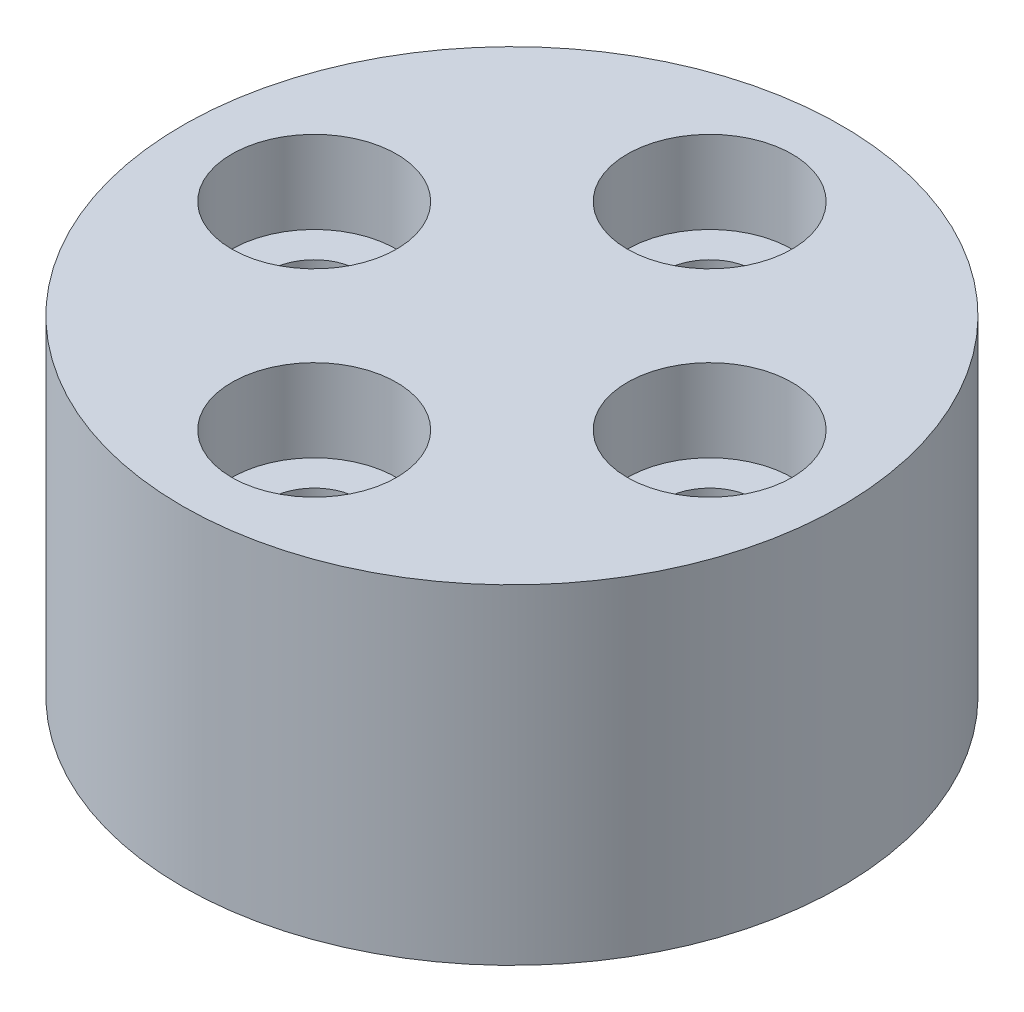
ISO-10303-21;
HEADER;
FILE_DESCRIPTION(('STEP AP214'),'2;1');
FILE_NAME('part.step','',(''),(''),'','','');
FILE_SCHEMA(('AUTOMOTIVE_DESIGN { 1 0 10303 214 1 1 1 1 }'));
ENDSEC;
DATA;
#1=APPLICATION_CONTEXT('core data for automotive mechanical design processes');
#2=APPLICATION_PROTOCOL_DEFINITION('international standard','automotive_design',2000,#1);
#3=PRODUCT_CONTEXT('',#1,'mechanical');
#4=PRODUCT('Part','Part','',(#3));
#5=PRODUCT_RELATED_PRODUCT_CATEGORY('part','',(#4));
#6=PRODUCT_DEFINITION_FORMATION('','',#4);
#7=PRODUCT_DEFINITION_CONTEXT('part definition',#1,'design');
#8=PRODUCT_DEFINITION('design','',#6,#7);
#9=PRODUCT_DEFINITION_SHAPE('','',#8);
#10=(LENGTH_UNIT() NAMED_UNIT(*) SI_UNIT(.MILLI.,.METRE.));
#11=(NAMED_UNIT(*) PLANE_ANGLE_UNIT() SI_UNIT($,.RADIAN.));
#12=(NAMED_UNIT(*) SI_UNIT($,.STERADIAN.) SOLID_ANGLE_UNIT());
#13=UNCERTAINTY_MEASURE_WITH_UNIT(LENGTH_MEASURE(1.E-05),#10,'distance_accuracy_value','');
#14=(GEOMETRIC_REPRESENTATION_CONTEXT(3) GLOBAL_UNCERTAINTY_ASSIGNED_CONTEXT((#13)) GLOBAL_UNIT_ASSIGNED_CONTEXT((#10,
#11,#12)) REPRESENTATION_CONTEXT('',''));
#15=CARTESIAN_POINT('',(0.,0.,0.));
#16=DIRECTION('',(0.,0.,1.));
#17=DIRECTION('',(1.,0.,0.));
#18=AXIS2_PLACEMENT_3D('',#15,#16,#17);
#19=CARTESIAN_POINT('',(0.,20.,0.));
#20=DIRECTION('',(0.,-1.,0.));
#21=DIRECTION('',(0.,0.,-1.));
#22=AXIS2_PLACEMENT_3D('',#19,#20,#21);
#23=CYLINDRICAL_SURFACE('',#22,20.);
#24=CARTESIAN_POINT('',(0.,20.,0.));
#25=DIRECTION('',(0.,1.,0.));
#26=DIRECTION('',(0.,0.,1.));
#27=AXIS2_PLACEMENT_3D('',#24,#25,#26);
#28=CIRCLE('',#27,20.);
#29=CARTESIAN_POINT('',(0.,20.,20.));
#30=VERTEX_POINT('',#29);
#31=EDGE_CURVE('E12',#30,#30,#28,.T.);
#32=ORIENTED_EDGE('',*,*,#31,.F.);
#33=EDGE_LOOP('',(#32));
#34=FACE_BOUND('',#33,.T.);
#35=CARTESIAN_POINT('',(0.,0.,0.));
#36=DIRECTION('',(0.,1.,0.));
#37=DIRECTION('',(0.,0.,1.));
#38=AXIS2_PLACEMENT_3D('',#35,#36,#37);
#39=CIRCLE('',#38,20.);
#40=CARTESIAN_POINT('',(0.,0.,20.));
#41=VERTEX_POINT('',#40);
#42=EDGE_CURVE('E56',#41,#41,#39,.T.);
#43=ORIENTED_EDGE('',*,*,#42,.T.);
#44=EDGE_LOOP('',(#43));
#45=FACE_BOUND('',#44,.T.);
#46=ADVANCED_FACE('F53',(#34,#45),#23,.T.);
#47=CARTESIAN_POINT('',(0.,20.,0.));
#48=DIRECTION('',(0.,1.,0.));
#49=DIRECTION('',(0.,0.,1.));
#50=AXIS2_PLACEMENT_3D('',#47,#48,#49);
#51=PLANE('',#50);
#52=CARTESIAN_POINT('',(0.,20.,-11.9999999999997));
#53=DIRECTION('',(0.,1.,0.));
#54=DIRECTION('',(0.,0.,1.));
#55=AXIS2_PLACEMENT_3D('',#52,#53,#54);
#56=CIRCLE('',#55,5.);
#57=CARTESIAN_POINT('',(0.,20.,-6.99999999999972));
#58=VERTEX_POINT('',#57);
#59=EDGE_CURVE('E128',#58,#58,#56,.T.);
#60=ORIENTED_EDGE('',*,*,#59,.F.);
#61=EDGE_LOOP('',(#60));
#62=FACE_BOUND('',#61,.T.);
#63=CARTESIAN_POINT('',(12.0000000000001,20.,0.));
#64=DIRECTION('',(0.,1.,0.));
#65=DIRECTION('',(0.,0.,1.));
#66=AXIS2_PLACEMENT_3D('',#63,#64,#65);
#67=CIRCLE('',#66,5.);
#68=CARTESIAN_POINT('',(12.0000000000001,20.,5.));
#69=VERTEX_POINT('',#68);
#70=EDGE_CURVE('E112',#69,#69,#67,.T.);
#71=ORIENTED_EDGE('',*,*,#70,.F.);
#72=EDGE_LOOP('',(#71));
#73=FACE_BOUND('',#72,.T.);
#74=CARTESIAN_POINT('',(0.,20.,12.0000000000003));
#75=DIRECTION('',(0.,1.,0.));
#76=DIRECTION('',(0.,0.,1.));
#77=AXIS2_PLACEMENT_3D('',#74,#75,#76);
#78=CIRCLE('',#77,5.);
#79=CARTESIAN_POINT('',(0.,20.,17.0000000000003));
#80=VERTEX_POINT('',#79);
#81=EDGE_CURVE('E96',#80,#80,#78,.T.);
#82=ORIENTED_EDGE('',*,*,#81,.F.);
#83=EDGE_LOOP('',(#82));
#84=FACE_BOUND('',#83,.T.);
#85=CARTESIAN_POINT('',(-11.9999999999999,20.,0.));
#86=DIRECTION('',(0.,1.,0.));
#87=DIRECTION('',(0.,0.,1.));
#88=AXIS2_PLACEMENT_3D('',#85,#86,#87);
#89=CIRCLE('',#88,5.);
#90=CARTESIAN_POINT('',(-11.9999999999999,20.,5.));
#91=VERTEX_POINT('',#90);
#92=EDGE_CURVE('E80',#91,#91,#89,.T.);
#93=ORIENTED_EDGE('',*,*,#92,.F.);
#94=EDGE_LOOP('',(#93));
#95=FACE_BOUND('',#94,.T.);
#96=ORIENTED_EDGE('',*,*,#31,.T.);
#97=EDGE_LOOP('',(#96));
#98=FACE_BOUND('',#97,.T.);
#99=ADVANCED_FACE('F137',(#62,#73,#84,#95,#98),#51,.T.);
#100=CARTESIAN_POINT('',(0.,0.,0.));
#101=DIRECTION('',(0.,1.,0.));
#102=DIRECTION('',(0.,0.,1.));
#103=AXIS2_PLACEMENT_3D('',#100,#101,#102);
#104=PLANE('',#103);
#105=CARTESIAN_POINT('',(0.,0.,-11.9999999999997));
#106=DIRECTION('',(0.,1.,0.));
#107=DIRECTION('',(0.,0.,1.));
#108=AXIS2_PLACEMENT_3D('',#105,#106,#107);
#109=CIRCLE('',#108,2.75);
#110=CARTESIAN_POINT('',(0.,0.,-9.24999999999972));
#111=VERTEX_POINT('',#110);
#112=EDGE_CURVE('E116',#111,#111,#109,.T.);
#113=ORIENTED_EDGE('',*,*,#112,.T.);
#114=EDGE_LOOP('',(#113));
#115=FACE_BOUND('',#114,.T.);
#116=CARTESIAN_POINT('',(12.0000000000001,0.,0.));
#117=DIRECTION('',(0.,1.,0.));
#118=DIRECTION('',(0.,0.,1.));
#119=AXIS2_PLACEMENT_3D('',#116,#117,#118);
#120=CIRCLE('',#119,2.75);
#121=CARTESIAN_POINT('',(12.0000000000001,0.,2.75));
#122=VERTEX_POINT('',#121);
#123=EDGE_CURVE('E100',#122,#122,#120,.T.);
#124=ORIENTED_EDGE('',*,*,#123,.T.);
#125=EDGE_LOOP('',(#124));
#126=FACE_BOUND('',#125,.T.);
#127=CARTESIAN_POINT('',(0.,0.,12.0000000000003));
#128=DIRECTION('',(0.,1.,0.));
#129=DIRECTION('',(0.,0.,1.));
#130=AXIS2_PLACEMENT_3D('',#127,#128,#129);
#131=CIRCLE('',#130,2.75);
#132=CARTESIAN_POINT('',(0.,0.,14.7500000000003));
#133=VERTEX_POINT('',#132);
#134=EDGE_CURVE('E84',#133,#133,#131,.T.);
#135=ORIENTED_EDGE('',*,*,#134,.T.);
#136=EDGE_LOOP('',(#135));
#137=FACE_BOUND('',#136,.T.);
#138=CARTESIAN_POINT('',(-11.9999999999999,0.,0.));
#139=DIRECTION('',(0.,1.,0.));
#140=DIRECTION('',(0.,0.,1.));
#141=AXIS2_PLACEMENT_3D('',#138,#139,#140);
#142=CIRCLE('',#141,2.75);
#143=CARTESIAN_POINT('',(-11.9999999999999,0.,2.75));
#144=VERTEX_POINT('',#143);
#145=EDGE_CURVE('E67',#144,#144,#142,.T.);
#146=ORIENTED_EDGE('',*,*,#145,.T.);
#147=EDGE_LOOP('',(#146));
#148=FACE_BOUND('',#147,.T.);
#149=ORIENTED_EDGE('',*,*,#42,.F.);
#150=EDGE_LOOP('',(#149));
#151=FACE_BOUND('',#150,.T.);
#152=ADVANCED_FACE('F140',(#115,#126,#137,#148,#151),#104,.F.);
#153=CARTESIAN_POINT('',(-11.9999999999999,20.,0.));
#154=DIRECTION('',(0.,1.,0.));
#155=DIRECTION('',(0.,0.,1.));
#156=AXIS2_PLACEMENT_3D('',#153,#154,#155);
#157=CYLINDRICAL_SURFACE('',#156,2.75);
#158=ORIENTED_EDGE('',*,*,#145,.F.);
#159=EDGE_LOOP('',(#158));
#160=FACE_BOUND('',#159,.T.);
#161=CARTESIAN_POINT('',(-11.9999999999999,15.,0.));
#162=DIRECTION('',(0.,1.,0.));
#163=DIRECTION('',(0.,0.,1.));
#164=AXIS2_PLACEMENT_3D('',#161,#162,#163);
#165=CIRCLE('',#164,2.75);
#166=CARTESIAN_POINT('',(-11.9999999999999,15.,2.75));
#167=VERTEX_POINT('',#166);
#168=EDGE_CURVE('E72',#167,#167,#165,.T.);
#169=ORIENTED_EDGE('',*,*,#168,.T.);
#170=EDGE_LOOP('',(#169));
#171=FACE_BOUND('',#170,.T.);
#172=ADVANCED_FACE('F161',(#160,#171),#157,.F.);
#173=CARTESIAN_POINT('',(-9.24999999999986,15.,0.));
#174=DIRECTION('',(0.,-1.,0.));
#175=DIRECTION('',(0.,0.,-1.));
#176=AXIS2_PLACEMENT_3D('',#173,#174,#175);
#177=PLANE('',#176);
#178=ORIENTED_EDGE('',*,*,#168,.F.);
#179=EDGE_LOOP('',(#178));
#180=FACE_BOUND('',#179,.T.);
#181=CARTESIAN_POINT('',(-11.9999999999999,15.,0.));
#182=DIRECTION('',(0.,1.,0.));
#183=DIRECTION('',(0.,0.,1.));
#184=AXIS2_PLACEMENT_3D('',#181,#182,#183);
#185=CIRCLE('',#184,5.);
#186=CARTESIAN_POINT('',(-11.9999999999999,15.,5.));
#187=VERTEX_POINT('',#186);
#188=EDGE_CURVE('E76',#187,#187,#185,.T.);
#189=ORIENTED_EDGE('',*,*,#188,.T.);
#190=EDGE_LOOP('',(#189));
#191=FACE_BOUND('',#190,.T.);
#192=ADVANCED_FACE('F151',(#180,#191),#177,.F.);
#193=CARTESIAN_POINT('',(-11.9999999999999,20.,0.));
#194=DIRECTION('',(0.,1.,0.));
#195=DIRECTION('',(0.,0.,1.));
#196=AXIS2_PLACEMENT_3D('',#193,#194,#195);
#197=CYLINDRICAL_SURFACE('',#196,5.);
#198=ORIENTED_EDGE('',*,*,#188,.F.);
#199=EDGE_LOOP('',(#198));
#200=FACE_BOUND('',#199,.T.);
#201=ORIENTED_EDGE('',*,*,#92,.T.);
#202=EDGE_LOOP('',(#201));
#203=FACE_BOUND('',#202,.T.);
#204=ADVANCED_FACE('F148',(#200,#203),#197,.F.);
#205=CARTESIAN_POINT('',(0.,20.,12.0000000000003));
#206=DIRECTION('',(0.,1.,0.));
#207=DIRECTION('',(0.,0.,1.));
#208=AXIS2_PLACEMENT_3D('',#205,#206,#207);
#209=CYLINDRICAL_SURFACE('',#208,2.75);
#210=ORIENTED_EDGE('',*,*,#134,.F.);
#211=EDGE_LOOP('',(#210));
#212=FACE_BOUND('',#211,.T.);
#213=CARTESIAN_POINT('',(0.,15.,12.0000000000003));
#214=DIRECTION('',(0.,1.,0.));
#215=DIRECTION('',(0.,0.,1.));
#216=AXIS2_PLACEMENT_3D('',#213,#214,#215);
#217=CIRCLE('',#216,2.75);
#218=CARTESIAN_POINT('',(0.,15.,14.7500000000003));
#219=VERTEX_POINT('',#218);
#220=EDGE_CURVE('E88',#219,#219,#217,.T.);
#221=ORIENTED_EDGE('',*,*,#220,.T.);
#222=EDGE_LOOP('',(#221));
#223=FACE_BOUND('',#222,.T.);
#224=ADVANCED_FACE('F150',(#212,#223),#209,.F.);
#225=CARTESIAN_POINT('',(2.75,15.,12.0000000000003));
#226=DIRECTION('',(0.,-1.,0.));
#227=DIRECTION('',(0.,0.,-1.));
#228=AXIS2_PLACEMENT_3D('',#225,#226,#227);
#229=PLANE('',#228);
#230=ORIENTED_EDGE('',*,*,#220,.F.);
#231=EDGE_LOOP('',(#230));
#232=FACE_BOUND('',#231,.T.);
#233=CARTESIAN_POINT('',(0.,15.,12.0000000000003));
#234=DIRECTION('',(0.,1.,0.));
#235=DIRECTION('',(0.,0.,1.));
#236=AXIS2_PLACEMENT_3D('',#233,#234,#235);
#237=CIRCLE('',#236,5.);
#238=CARTESIAN_POINT('',(0.,15.,17.0000000000003));
#239=VERTEX_POINT('',#238);
#240=EDGE_CURVE('E92',#239,#239,#237,.T.);
#241=ORIENTED_EDGE('',*,*,#240,.T.);
#242=EDGE_LOOP('',(#241));
#243=FACE_BOUND('',#242,.T.);
#244=ADVANCED_FACE('F158',(#232,#243),#229,.F.);
#245=CARTESIAN_POINT('',(0.,20.,12.0000000000003));
#246=DIRECTION('',(0.,1.,0.));
#247=DIRECTION('',(0.,0.,1.));
#248=AXIS2_PLACEMENT_3D('',#245,#246,#247);
#249=CYLINDRICAL_SURFACE('',#248,5.);
#250=ORIENTED_EDGE('',*,*,#240,.F.);
#251=EDGE_LOOP('',(#250));
#252=FACE_BOUND('',#251,.T.);
#253=ORIENTED_EDGE('',*,*,#81,.T.);
#254=EDGE_LOOP('',(#253));
#255=FACE_BOUND('',#254,.T.);
#256=ADVANCED_FACE('F194',(#252,#255),#249,.F.);
#257=CARTESIAN_POINT('',(12.0000000000001,20.,0.));
#258=DIRECTION('',(0.,1.,0.));
#259=DIRECTION('',(0.,0.,1.));
#260=AXIS2_PLACEMENT_3D('',#257,#258,#259);
#261=CYLINDRICAL_SURFACE('',#260,2.75);
#262=ORIENTED_EDGE('',*,*,#123,.F.);
#263=EDGE_LOOP('',(#262));
#264=FACE_BOUND('',#263,.T.);
#265=CARTESIAN_POINT('',(12.0000000000001,15.,0.));
#266=DIRECTION('',(0.,1.,0.));
#267=DIRECTION('',(0.,0.,1.));
#268=AXIS2_PLACEMENT_3D('',#265,#266,#267);
#269=CIRCLE('',#268,2.75);
#270=CARTESIAN_POINT('',(12.0000000000001,15.,2.75));
#271=VERTEX_POINT('',#270);
#272=EDGE_CURVE('E104',#271,#271,#269,.T.);
#273=ORIENTED_EDGE('',*,*,#272,.T.);
#274=EDGE_LOOP('',(#273));
#275=FACE_BOUND('',#274,.T.);
#276=ADVANCED_FACE('F200',(#264,#275),#261,.F.);
#277=CARTESIAN_POINT('',(14.7500000000001,15.,0.));
#278=DIRECTION('',(0.,-1.,0.));
#279=DIRECTION('',(0.,0.,-1.));
#280=AXIS2_PLACEMENT_3D('',#277,#278,#279);
#281=PLANE('',#280);
#282=ORIENTED_EDGE('',*,*,#272,.F.);
#283=EDGE_LOOP('',(#282));
#284=FACE_BOUND('',#283,.T.);
#285=CARTESIAN_POINT('',(12.0000000000001,15.,0.));
#286=DIRECTION('',(0.,1.,0.));
#287=DIRECTION('',(0.,0.,1.));
#288=AXIS2_PLACEMENT_3D('',#285,#286,#287);
#289=CIRCLE('',#288,5.);
#290=CARTESIAN_POINT('',(12.0000000000001,15.,5.));
#291=VERTEX_POINT('',#290);
#292=EDGE_CURVE('E108',#291,#291,#289,.T.);
#293=ORIENTED_EDGE('',*,*,#292,.T.);
#294=EDGE_LOOP('',(#293));
#295=FACE_BOUND('',#294,.T.);
#296=ADVANCED_FACE('F205',(#284,#295),#281,.F.);
#297=CARTESIAN_POINT('',(12.0000000000001,20.,0.));
#298=DIRECTION('',(0.,1.,0.));
#299=DIRECTION('',(0.,0.,1.));
#300=AXIS2_PLACEMENT_3D('',#297,#298,#299);
#301=CYLINDRICAL_SURFACE('',#300,5.);
#302=ORIENTED_EDGE('',*,*,#292,.F.);
#303=EDGE_LOOP('',(#302));
#304=FACE_BOUND('',#303,.T.);
#305=ORIENTED_EDGE('',*,*,#70,.T.);
#306=EDGE_LOOP('',(#305));
#307=FACE_BOUND('',#306,.T.);
#308=ADVANCED_FACE('F211',(#304,#307),#301,.F.);
#309=CARTESIAN_POINT('',(0.,20.,-11.9999999999997));
#310=DIRECTION('',(0.,1.,0.));
#311=DIRECTION('',(0.,0.,1.));
#312=AXIS2_PLACEMENT_3D('',#309,#310,#311);
#313=CYLINDRICAL_SURFACE('',#312,2.75);
#314=ORIENTED_EDGE('',*,*,#112,.F.);
#315=EDGE_LOOP('',(#314));
#316=FACE_BOUND('',#315,.T.);
#317=CARTESIAN_POINT('',(0.,15.,-11.9999999999997));
#318=DIRECTION('',(0.,1.,0.));
#319=DIRECTION('',(0.,0.,1.));
#320=AXIS2_PLACEMENT_3D('',#317,#318,#319);
#321=CIRCLE('',#320,2.75);
#322=CARTESIAN_POINT('',(0.,15.,-9.24999999999972));
#323=VERTEX_POINT('',#322);
#324=EDGE_CURVE('E120',#323,#323,#321,.T.);
#325=ORIENTED_EDGE('',*,*,#324,.T.);
#326=EDGE_LOOP('',(#325));
#327=FACE_BOUND('',#326,.T.);
#328=ADVANCED_FACE('F215',(#316,#327),#313,.F.);
#329=CARTESIAN_POINT('',(2.75,15.,-11.9999999999997));
#330=DIRECTION('',(0.,-1.,0.));
#331=DIRECTION('',(0.,0.,-1.));
#332=AXIS2_PLACEMENT_3D('',#329,#330,#331);
#333=PLANE('',#332);
#334=ORIENTED_EDGE('',*,*,#324,.F.);
#335=EDGE_LOOP('',(#334));
#336=FACE_BOUND('',#335,.T.);
#337=CARTESIAN_POINT('',(0.,15.,-11.9999999999997));
#338=DIRECTION('',(0.,1.,0.));
#339=DIRECTION('',(0.,0.,1.));
#340=AXIS2_PLACEMENT_3D('',#337,#338,#339);
#341=CIRCLE('',#340,5.);
#342=CARTESIAN_POINT('',(0.,15.,-6.99999999999972));
#343=VERTEX_POINT('',#342);
#344=EDGE_CURVE('E124',#343,#343,#341,.T.);
#345=ORIENTED_EDGE('',*,*,#344,.T.);
#346=EDGE_LOOP('',(#345));
#347=FACE_BOUND('',#346,.T.);
#348=ADVANCED_FACE('F219',(#336,#347),#333,.F.);
#349=CARTESIAN_POINT('',(0.,20.,-11.9999999999997));
#350=DIRECTION('',(0.,1.,0.));
#351=DIRECTION('',(0.,0.,1.));
#352=AXIS2_PLACEMENT_3D('',#349,#350,#351);
#353=CYLINDRICAL_SURFACE('',#352,5.);
#354=ORIENTED_EDGE('',*,*,#344,.F.);
#355=EDGE_LOOP('',(#354));
#356=FACE_BOUND('',#355,.T.);
#357=ORIENTED_EDGE('',*,*,#59,.T.);
#358=EDGE_LOOP('',(#357));
#359=FACE_BOUND('',#358,.T.);
#360=ADVANCED_FACE('F135',(#356,#359),#353,.F.);
#361=CLOSED_SHELL('',(#46,#99,#152,#172,#192,#204,#224,#244,#256,#276,#296,#308,#328,#348,#360));
#362=MANIFOLD_SOLID_BREP('B2',#361);
#363=ADVANCED_BREP_SHAPE_REPRESENTATION('',(#18,#362),#14);
#364=SHAPE_DEFINITION_REPRESENTATION(#9,#363);
ENDSEC;
END-ISO-10303-21;
